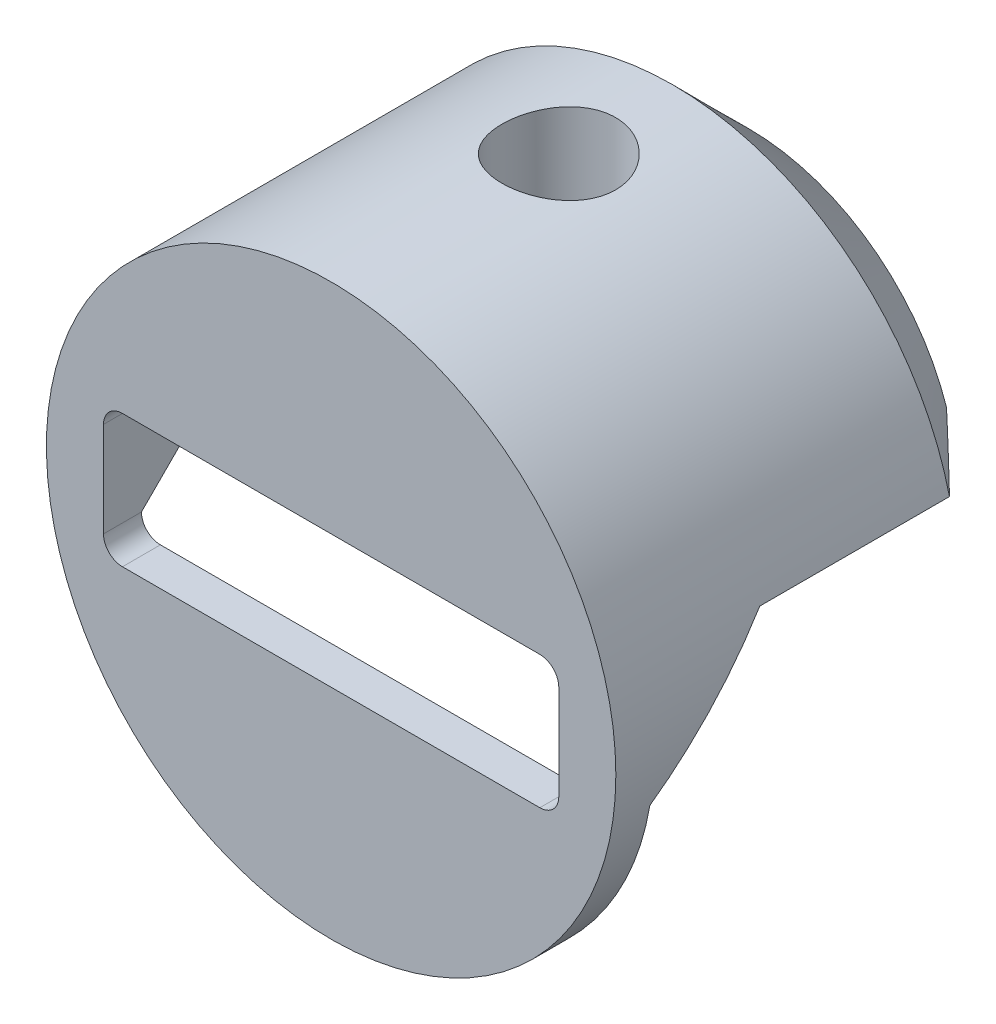
ISO-10303-21;
HEADER;
FILE_DESCRIPTION(('STEP AP214'),'2;1');
FILE_NAME('part.step','',(''),(''),'','','');
FILE_SCHEMA(('AUTOMOTIVE_DESIGN { 1 0 10303 214 1 1 1 1 }'));
ENDSEC;
DATA;
#1=APPLICATION_CONTEXT('core data for automotive mechanical design processes');
#2=APPLICATION_PROTOCOL_DEFINITION('international standard','automotive_design',2000,#1);
#3=PRODUCT_CONTEXT('',#1,'mechanical');
#4=PRODUCT('Part','Part','',(#3));
#5=PRODUCT_RELATED_PRODUCT_CATEGORY('part','',(#4));
#6=PRODUCT_DEFINITION_FORMATION('','',#4);
#7=PRODUCT_DEFINITION_CONTEXT('part definition',#1,'design');
#8=PRODUCT_DEFINITION('design','',#6,#7);
#9=PRODUCT_DEFINITION_SHAPE('','',#8);
#10=(LENGTH_UNIT() NAMED_UNIT(*) SI_UNIT(.MILLI.,.METRE.));
#11=(NAMED_UNIT(*) PLANE_ANGLE_UNIT() SI_UNIT($,.RADIAN.));
#12=(NAMED_UNIT(*) SI_UNIT($,.STERADIAN.) SOLID_ANGLE_UNIT());
#13=UNCERTAINTY_MEASURE_WITH_UNIT(LENGTH_MEASURE(1.E-05),#10,'distance_accuracy_value','');
#14=(GEOMETRIC_REPRESENTATION_CONTEXT(3) GLOBAL_UNCERTAINTY_ASSIGNED_CONTEXT((#13)) GLOBAL_UNIT_ASSIGNED_CONTEXT((#10,
#11,#12)) REPRESENTATION_CONTEXT('',''));
#15=CARTESIAN_POINT('',(0.,0.,0.));
#16=DIRECTION('',(0.,0.,1.));
#17=DIRECTION('',(1.,0.,0.));
#18=AXIS2_PLACEMENT_3D('',#15,#16,#17);
#19=CARTESIAN_POINT('',(0.,0.,0.));
#20=DIRECTION('',(0.,0.,1.));
#21=DIRECTION('',(1.,0.,0.));
#22=AXIS2_PLACEMENT_3D('',#19,#20,#21);
#23=PLANE('',#22);
#24=CARTESIAN_POINT('',(17.4625,-3.96875,0.));
#25=DIRECTION('',(0.,0.,1.));
#26=DIRECTION('',(1.,0.,0.));
#27=AXIS2_PLACEMENT_3D('',#24,#25,#26);
#28=CIRCLE('',#27,1.5875);
#29=CARTESIAN_POINT('',(17.4625,-5.55625,0.));
#30=VERTEX_POINT('',#29);
#31=CARTESIAN_POINT('',(19.05,-3.96875,0.));
#32=VERTEX_POINT('',#31);
#33=EDGE_CURVE('E176',#30,#32,#28,.T.);
#34=ORIENTED_EDGE('',*,*,#33,.T.);
#35=DIRECTION('',(1.,0.,0.));
#36=VECTOR('',#35,1.);
#37=CARTESIAN_POINT('',(23.1682593428488,-3.96874999999997,0.));
#38=LINE('',#37,#36);
#39=CARTESIAN_POINT('',(23.492321691938,-3.96874999999997,0.));
#40=VERTEX_POINT('',#39);
#41=EDGE_CURVE('E191',#32,#40,#38,.T.);
#42=ORIENTED_EDGE('',*,*,#41,.T.);
#43=CARTESIAN_POINT('',(0.,0.,0.));
#44=DIRECTION('',(0.,0.,1.));
#45=DIRECTION('',(1.,0.,0.));
#46=AXIS2_PLACEMENT_3D('',#43,#44,#45);
#47=CIRCLE('',#46,23.8252);
#48=CARTESIAN_POINT('',(-23.492321691938,-3.96874999999997,0.));
#49=VERTEX_POINT('',#48);
#50=EDGE_CURVE('E150',#49,#40,#47,.T.);
#51=ORIENTED_EDGE('',*,*,#50,.F.);
#52=DIRECTION('',(1.,0.,0.));
#53=VECTOR('',#52,1.);
#54=CARTESIAN_POINT('',(-17.4625,-3.96874999999997,0.));
#55=LINE('',#54,#53);
#56=CARTESIAN_POINT('',(-19.05,-3.96875,0.));
#57=VERTEX_POINT('',#56);
#58=EDGE_CURVE('E189',#49,#57,#55,.T.);
#59=ORIENTED_EDGE('',*,*,#58,.T.);
#60=CARTESIAN_POINT('',(-17.4625,-3.96875,0.));
#61=DIRECTION('',(0.,0.,1.));
#62=DIRECTION('',(1.,0.,0.));
#63=AXIS2_PLACEMENT_3D('',#60,#61,#62);
#64=CIRCLE('',#63,1.5875);
#65=CARTESIAN_POINT('',(-17.4625,-5.55625,0.));
#66=VERTEX_POINT('',#65);
#67=EDGE_CURVE('E130',#57,#66,#64,.T.);
#68=ORIENTED_EDGE('',*,*,#67,.T.);
#69=DIRECTION('',(1.,0.,0.));
#70=VECTOR('',#69,1.);
#71=CARTESIAN_POINT('',(-19.05,-5.55625,0.));
#72=LINE('',#71,#70);
#73=EDGE_CURVE('E140',#66,#30,#72,.T.);
#74=ORIENTED_EDGE('',*,*,#73,.T.);
#75=EDGE_LOOP('',(#34,#42,#51,#59,#68,#74));
#76=FACE_BOUND('',#75,.T.);
#77=ADVANCED_FACE('F32',(#76),#23,.F.);
#78=CARTESIAN_POINT('',(0.,0.,3.175));
#79=DIRECTION('',(0.,0.,-1.));
#80=DIRECTION('',(-1.,0.,0.));
#81=AXIS2_PLACEMENT_3D('',#78,#79,#80);
#82=CYLINDRICAL_SURFACE('',#81,23.8252);
#83=CARTESIAN_POINT('',(0.,23.8252,-11.1125));
#84=CARTESIAN_POINT('',(-0.26468798628504,23.8251951226979,-11.1125097405284));
#85=CARTESIAN_POINT('',(-0.529499143477237,23.8207438683323,-11.1346406112875));
#86=CARTESIAN_POINT('',(-1.051636545125,23.8034162854459,-11.2225091782623));
#87=CARTESIAN_POINT('',(-1.30895667009785,23.7905332600903,-11.2882815367889));
#88=CARTESIAN_POINT('',(-1.80848726659535,23.7577807317868,-11.461320228174));
#89=CARTESIAN_POINT('',(-2.05071194625906,23.7379179189587,-11.5685468369962));
#90=CARTESIAN_POINT('',(-2.51371611976274,23.693365181789,-11.8213322650753));
#91=CARTESIAN_POINT('',(-2.73449689373966,23.6686755458597,-11.966888794223));
#92=CARTESIAN_POINT('',(-3.15134989484519,23.6168130916919,-12.2942900255091));
#93=CARTESIAN_POINT('',(-3.34709020597491,23.5896138029903,-12.476553177339));
#94=CARTESIAN_POINT('',(-3.7054319432322,23.5359901883143,-12.8712943458714));
#95=CARTESIAN_POINT('',(-3.86803078304261,23.5095659229592,-13.0837747184914));
#96=CARTESIAN_POINT('',(-4.15688647253994,23.460225713389,-13.5353059021012));
#97=CARTESIAN_POINT('',(-4.2827996943948,23.4373438273569,-13.7745805913275));
#98=CARTESIAN_POINT('',(-4.49250853830897,23.3980550251738,-14.2714228610609));
#99=CARTESIAN_POINT('',(-4.57630831645973,23.3816474701185,-14.5289886335933));
#100=CARTESIAN_POINT('',(-4.69833409248501,23.3574328374087,-15.0515308479983));
#101=CARTESIAN_POINT('',(-4.73714240094976,23.3495159704266,-15.3163661153228));
#102=CARTESIAN_POINT('',(-4.76989230678561,23.3428486218898,-15.8488979880102));
#103=CARTESIAN_POINT('',(-4.76383848688287,23.3440972040721,-16.1165942983241));
#104=CARTESIAN_POINT('',(-4.70750679862519,23.3555199246904,-16.6429893633404));
#105=CARTESIAN_POINT('',(-4.65789642626372,23.3655593391066,-16.9017629090314));
#106=CARTESIAN_POINT('',(-4.51691348526417,23.3932204072653,-17.4072384759464));
#107=CARTESIAN_POINT('',(-4.42553892411795,23.4108424227603,-17.6539399206065));
#108=CARTESIAN_POINT('',(-4.20298388778795,23.4518209024325,-18.13019224204));
#109=CARTESIAN_POINT('',(-4.07153879776745,23.4752152837995,-18.3596160653276));
#110=CARTESIAN_POINT('',(-3.77276065905317,23.5250781856318,-18.7934007804313));
#111=CARTESIAN_POINT('',(-3.60542349013793,23.5515470588726,-18.9977587905872));
#112=CARTESIAN_POINT('',(-3.23603720806696,23.6051602461935,-19.3794625389199));
#113=CARTESIAN_POINT('',(-3.03341838696737,23.632308150872,-19.5562569098447));
#114=CARTESIAN_POINT('',(-2.60111373354849,23.6837849672359,-19.8734353224583));
#115=CARTESIAN_POINT('',(-2.37142755485921,23.7081138428394,-20.0138188981393));
#116=CARTESIAN_POINT('',(-1.89089599288597,23.751271088371,-20.2542925775217));
#117=CARTESIAN_POINT('',(-1.64001827019372,23.7700908483035,-20.3543197008983));
#118=CARTESIAN_POINT('',(-1.12455933520331,23.8000440143785,-20.5106534569724));
#119=CARTESIAN_POINT('',(-0.859979785236095,23.8111783505931,-20.5669653800851));
#120=CARTESIAN_POINT('',(-0.329365799052263,23.8243766192916,-20.6334897510486));
#121=CARTESIAN_POINT('',(-0.0634295428226747,23.8265890023631,-20.6444567624915));
#122=CARTESIAN_POINT('',(0.466475600664106,23.8221064051307,-20.6220120613979));
#123=CARTESIAN_POINT('',(0.730444597555633,23.8154119249913,-20.5886028408071));
#124=CARTESIAN_POINT('',(1.24648820062702,23.7939606956564,-20.4789809192764));
#125=CARTESIAN_POINT('',(1.49864834022506,23.7792768950398,-20.4031553384192));
#126=CARTESIAN_POINT('',(1.9866752164669,23.7434875435489,-20.2112760989188));
#127=CARTESIAN_POINT('',(2.2225407317865,23.7223815119511,-20.0952194287661));
#128=CARTESIAN_POINT('',(2.67446558734583,23.6757192769061,-19.8245397116214));
#129=CARTESIAN_POINT('',(2.89024739234771,23.6501118006517,-19.6694623195766));
#130=CARTESIAN_POINT('',(3.29299604846084,23.5974079305252,-19.325751656197));
#131=CARTESIAN_POINT('',(3.47995980972587,23.5703113774173,-19.1371147913085));
#132=CARTESIAN_POINT('',(3.82267696210409,23.5171829860366,-18.7282050729517));
#133=CARTESIAN_POINT('',(3.97791237112328,23.4911736116975,-18.5074946625058));
#134=CARTESIAN_POINT('',(4.24910849107445,23.4436402043821,-18.0426879104587));
#135=CARTESIAN_POINT('',(4.36507077251343,23.4221159920603,-17.7985925045091));
#136=CARTESIAN_POINT('',(4.55372148776744,23.3861713550083,-17.295173592899));
#137=CARTESIAN_POINT('',(4.62663414956219,23.3717141899794,-17.0359368626934));
#138=CARTESIAN_POINT('',(4.72779601677021,23.3514626755826,-16.5085717799287));
#139=CARTESIAN_POINT('',(4.75605103956951,23.3456671978939,-16.2404445901437));
#140=CARTESIAN_POINT('',(4.76688045509302,23.343457835273,-15.7081102898444));
#141=CARTESIAN_POINT('',(4.75027334199977,23.3468758508765,-15.4439201878407));
#142=CARTESIAN_POINT('',(4.67365621591802,23.3623327917658,-14.9221807235454));
#143=CARTESIAN_POINT('',(4.61364655074543,23.3743716479666,-14.6646313080544));
#144=CARTESIAN_POINT('',(4.4522927130697,23.4056386743259,-14.164004180388));
#145=CARTESIAN_POINT('',(4.35104880616727,23.4248493959242,-13.9208929916534));
#146=CARTESIAN_POINT('',(4.1101943499799,23.4683055894606,-13.4549797519493));
#147=CARTESIAN_POINT('',(3.97058058793866,23.4925514829584,-13.2321794037133));
#148=CARTESIAN_POINT('',(3.65415355273115,23.5438605220351,-12.8091365090426));
#149=CARTESIAN_POINT('',(3.47674915024675,23.5709644976961,-12.6093409861549));
#150=CARTESIAN_POINT('',(3.09099715455224,23.6246425923784,-12.2420842713216));
#151=CARTESIAN_POINT('',(2.88264245988113,23.6512165882057,-12.0746305204446));
#152=CARTESIAN_POINT('',(2.43828745704218,23.7011680331646,-11.7751582301449));
#153=CARTESIAN_POINT('',(2.20202095356028,23.7245091681388,-11.6435283611549));
#154=CARTESIAN_POINT('',(1.71032148041436,23.76500754123,-11.4220486949781));
#155=CARTESIAN_POINT('',(1.45490603494739,23.7821703519664,-11.3321612263583));
#156=CARTESIAN_POINT('',(0.999096399441274,23.8050427288747,-11.2141333985186));
#157=CARTESIAN_POINT('',(0.801297508733566,23.8125574811857,-11.1760888033963));
#158=CARTESIAN_POINT('',(0.4023560674452,23.8226378918748,-11.1252688037122));
#159=CARTESIAN_POINT('',(0.201213623432525,23.8252037076848,-11.1124925953307));
#160=CARTESIAN_POINT('',(0.,23.8252,-11.1125));
#161=B_SPLINE_CURVE_WITH_KNOTS('',3,(#83,#84,#85,#86,#87,#88,#89,#90,#91,#92,#93,#94,#95,#96,
#97,#98,#99,#100,#101,#102,#103,#104,#105,#106,#107,#108,#109,#110,#111,#112,#113,#114,#115,
#116,#117,#118,#119,#120,#121,#122,#123,#124,#125,#126,#127,#128,#129,#130,#131,#132,#133,#134,
#135,#136,#137,#138,#139,#140,#141,#142,#143,#144,#145,#146,#147,#148,#149,#150,#151,#152,#153,
#154,#155,#156,#157,#158,#159,#160),.UNSPECIFIED.,.T.,.F.,(4,2,2,2,2,2,2,2,2,2,2,2,2,2,2,2,2,2,
2,2,2,2,2,2,2,2,2,2,2,2,2,2,2,2,2,2,2,2,4),(0.,0.793327860915134,1.58728657901616,
2.38048635489683,3.17363874998478,3.97640459937808,4.77923307160471,5.58935606576586,
6.39939909480266,7.19883663006741,7.99819250284918,8.78550811776589,9.57286129827623,
10.3655309125319,11.1582915698278,11.9652973343436,12.7723134269064,13.5805841228718,
14.3887569866304,15.183425921418,15.9780502334881,16.7655378910984,17.5530845090494,
18.3502636420721,19.1475281885986,19.9569195480793,20.7662785366994,21.5713838393825,
22.3763842553186,23.1667973739987,23.9572041585993,24.7457003490998,25.5342625815049,
26.3362081655445,27.1383380388656,27.9488519432575,28.75863295152,29.3617334319436,
29.9648147266601),.UNSPECIFIED.);
#162=CARTESIAN_POINT('',(0.,23.8252,-11.1125));
#163=VERTEX_POINT('',#162);
#164=EDGE_CURVE('E209',#163,#163,#161,.T.);
#165=ORIENTED_EDGE('',*,*,#164,.T.);
#166=EDGE_LOOP('',(#165));
#167=FACE_BOUND('',#166,.T.);
#168=CARTESIAN_POINT('',(0.,0.,3.175));
#169=DIRECTION('',(0.,0.,1.));
#170=DIRECTION('',(1.,0.,0.));
#171=AXIS2_PLACEMENT_3D('',#168,#169,#170);
#172=CIRCLE('',#171,23.8252);
#173=CARTESIAN_POINT('',(23.8252,0.,3.175));
#174=VERTEX_POINT('',#173);
#175=EDGE_CURVE('E156',#174,#174,#172,.T.);
#176=ORIENTED_EDGE('',*,*,#175,.F.);
#177=EDGE_LOOP('',(#176));
#178=FACE_BOUND('',#177,.T.);
#179=DIRECTION('',(0.,0.,1.));
#180=VECTOR('',#179,1.);
#181=CARTESIAN_POINT('',(23.1682593428488,5.55625,-31.75));
#182=LINE('',#181,#180);
#183=CARTESIAN_POINT('',(23.1682593428488,5.55625,-25.4));
#184=VERTEX_POINT('',#183);
#185=CARTESIAN_POINT('',(23.1682593428488,5.55625,-9.52500000000006));
#186=VERTEX_POINT('',#185);
#187=EDGE_CURVE('E274',#184,#186,#182,.T.);
#188=ORIENTED_EDGE('',*,*,#187,.F.);
#189=CARTESIAN_POINT('',(0.,0.,-25.4));
#190=DIRECTION('',(0.,0.,-1.));
#191=DIRECTION('',(-1.,0.,0.));
#192=AXIS2_PLACEMENT_3D('',#189,#190,#191);
#193=CIRCLE('',#192,23.8252);
#194=CARTESIAN_POINT('',(-23.1682593428488,5.55625,-25.4));
#195=VERTEX_POINT('',#194);
#196=EDGE_CURVE('E11',#184,#195,#193,.F.);
#197=ORIENTED_EDGE('',*,*,#196,.T.);
#198=DIRECTION('',(0.,0.,1.));
#199=VECTOR('',#198,1.);
#200=CARTESIAN_POINT('',(-23.1682593428488,5.55625,-31.75));
#201=LINE('',#200,#199);
#202=CARTESIAN_POINT('',(-23.1682593428488,5.55625,-9.52500000000006));
#203=VERTEX_POINT('',#202);
#204=EDGE_CURVE('E276',#195,#203,#201,.T.);
#205=ORIENTED_EDGE('',*,*,#204,.T.);
#206=CARTESIAN_POINT('',(0.,0.,-3.96875000000001));
#207=DIRECTION('',(0.,-0.707106781186551,-0.707106781186544));
#208=DIRECTION('',(0.,0.707106781186544,-0.707106781186551));
#209=AXIS2_PLACEMENT_3D('',#206,#207,#208);
#210=ELLIPSE('',#209,33.6939209662516,23.8252);
#211=EDGE_CURVE('E201',#203,#49,#210,.F.);
#212=ORIENTED_EDGE('',*,*,#211,.T.);
#213=ORIENTED_EDGE('',*,*,#50,.T.);
#214=CARTESIAN_POINT('',(0.,0.,-3.96875000000001));
#215=DIRECTION('',(0.,-0.707106781186551,-0.707106781186544));
#216=DIRECTION('',(0.,0.707106781186544,-0.707106781186551));
#217=AXIS2_PLACEMENT_3D('',#214,#215,#216);
#218=ELLIPSE('',#217,33.6939209662516,23.8252);
#219=EDGE_CURVE('E198',#40,#186,#218,.F.);
#220=ORIENTED_EDGE('',*,*,#219,.T.);
#221=EDGE_LOOP('',(#188,#197,#205,#212,#213,#220));
#222=FACE_BOUND('',#221,.T.);
#223=ADVANCED_FACE('F220',(#167,#178,#222),#82,.T.);
#224=CARTESIAN_POINT('',(0.,0.,3.175));
#225=DIRECTION('',(0.,0.,1.));
#226=DIRECTION('',(1.,0.,0.));
#227=AXIS2_PLACEMENT_3D('',#224,#225,#226);
#228=PLANE('',#227);
#229=DIRECTION('',(0.,1.,0.));
#230=VECTOR('',#229,1.);
#231=CARTESIAN_POINT('',(19.05,-5.55625,3.175));
#232=LINE('',#231,#230);
#233=CARTESIAN_POINT('',(19.05,-3.96875,3.175));
#234=VERTEX_POINT('',#233);
#235=CARTESIAN_POINT('',(19.05,3.96875,3.175));
#236=VERTEX_POINT('',#235);
#237=EDGE_CURVE('E283',#234,#236,#232,.T.);
#238=ORIENTED_EDGE('',*,*,#237,.F.);
#239=CARTESIAN_POINT('',(17.4625,-3.96875,3.175));
#240=DIRECTION('',(0.,0.,1.));
#241=DIRECTION('',(1.,0.,0.));
#242=AXIS2_PLACEMENT_3D('',#239,#240,#241);
#243=CIRCLE('',#242,1.5875);
#244=CARTESIAN_POINT('',(17.4625,-5.55625,3.175));
#245=VERTEX_POINT('',#244);
#246=EDGE_CURVE('E147',#234,#245,#243,.F.);
#247=ORIENTED_EDGE('',*,*,#246,.T.);
#248=DIRECTION('',(1.,0.,0.));
#249=VECTOR('',#248,1.);
#250=CARTESIAN_POINT('',(-19.05,-5.55625,3.175));
#251=LINE('',#250,#249);
#252=CARTESIAN_POINT('',(-17.4625,-5.55625,3.175));
#253=VERTEX_POINT('',#252);
#254=EDGE_CURVE('E137',#253,#245,#251,.T.);
#255=ORIENTED_EDGE('',*,*,#254,.F.);
#256=CARTESIAN_POINT('',(-17.4625,-3.96875,3.175));
#257=DIRECTION('',(0.,0.,1.));
#258=DIRECTION('',(1.,0.,0.));
#259=AXIS2_PLACEMENT_3D('',#256,#257,#258);
#260=CIRCLE('',#259,1.5875);
#261=CARTESIAN_POINT('',(-19.05,-3.96875,3.175));
#262=VERTEX_POINT('',#261);
#263=EDGE_CURVE('E119',#253,#262,#260,.F.);
#264=ORIENTED_EDGE('',*,*,#263,.T.);
#265=DIRECTION('',(0.,-1.,0.));
#266=VECTOR('',#265,1.);
#267=CARTESIAN_POINT('',(-19.05,-5.55625,3.175));
#268=LINE('',#267,#266);
#269=CARTESIAN_POINT('',(-19.05,3.96875,3.175));
#270=VERTEX_POINT('',#269);
#271=EDGE_CURVE('E148',#270,#262,#268,.T.);
#272=ORIENTED_EDGE('',*,*,#271,.F.);
#273=CARTESIAN_POINT('',(-17.4625,3.96875,3.175));
#274=DIRECTION('',(0.,0.,1.));
#275=DIRECTION('',(1.,0.,0.));
#276=AXIS2_PLACEMENT_3D('',#273,#274,#275);
#277=CIRCLE('',#276,1.5875);
#278=CARTESIAN_POINT('',(-17.4625,5.55625,3.175));
#279=VERTEX_POINT('',#278);
#280=EDGE_CURVE('E181',#270,#279,#277,.F.);
#281=ORIENTED_EDGE('',*,*,#280,.T.);
#282=DIRECTION('',(-1.,0.,0.));
#283=VECTOR('',#282,1.);
#284=CARTESIAN_POINT('',(-19.05,5.55625,3.175));
#285=LINE('',#284,#283);
#286=CARTESIAN_POINT('',(17.4625,5.55625,3.175));
#287=VERTEX_POINT('',#286);
#288=EDGE_CURVE('E152',#287,#279,#285,.T.);
#289=ORIENTED_EDGE('',*,*,#288,.F.);
#290=CARTESIAN_POINT('',(17.4625,3.96875,3.175));
#291=DIRECTION('',(0.,0.,1.));
#292=DIRECTION('',(1.,0.,0.));
#293=AXIS2_PLACEMENT_3D('',#290,#291,#292);
#294=CIRCLE('',#293,1.5875);
#295=EDGE_CURVE('E179',#287,#236,#294,.F.);
#296=ORIENTED_EDGE('',*,*,#295,.T.);
#297=EDGE_LOOP('',(#238,#247,#255,#264,#272,#281,#289,#296));
#298=FACE_BOUND('',#297,.T.);
#299=ORIENTED_EDGE('',*,*,#175,.T.);
#300=EDGE_LOOP('',(#299));
#301=FACE_BOUND('',#300,.T.);
#302=ADVANCED_FACE('F145',(#298,#301),#228,.T.);
#303=CARTESIAN_POINT('',(19.05,-5.55625,0.));
#304=DIRECTION('',(1.,0.,0.));
#305=DIRECTION('',(0.,0.,-1.));
#306=AXIS2_PLACEMENT_3D('',#303,#304,#305);
#307=PLANE('',#306);
#308=DIRECTION('',(0.,0.,1.));
#309=VECTOR('',#308,1.);
#310=CARTESIAN_POINT('',(19.05,3.96875,0.));
#311=LINE('',#310,#309);
#312=CARTESIAN_POINT('',(19.05,3.96875,-7.93750000000005));
#313=VERTEX_POINT('',#312);
#314=EDGE_CURVE('E165',#236,#313,#311,.F.);
#315=ORIENTED_EDGE('',*,*,#314,.T.);
#316=DIRECTION('',(0.,0.707106781186544,-0.707106781186551));
#317=VECTOR('',#316,1.);
#318=CARTESIAN_POINT('',(19.05,-4.76249999999998,0.793750000000014));
#319=LINE('',#318,#317);
#320=EDGE_CURVE('E196',#313,#32,#319,.F.);
#321=ORIENTED_EDGE('',*,*,#320,.T.);
#322=DIRECTION('',(0.,0.,1.));
#323=VECTOR('',#322,1.);
#324=CARTESIAN_POINT('',(19.05,-3.96875,3.175));
#325=LINE('',#324,#323);
#326=EDGE_CURVE('E167',#32,#234,#325,.T.);
#327=ORIENTED_EDGE('',*,*,#326,.T.);
#328=ORIENTED_EDGE('',*,*,#237,.T.);
#329=EDGE_LOOP('',(#315,#321,#327,#328));
#330=FACE_BOUND('',#329,.T.);
#331=ADVANCED_FACE('F247',(#330),#307,.F.);
#332=CARTESIAN_POINT('',(-19.05,-5.55625,0.));
#333=DIRECTION('',(0.,-1.,0.));
#334=DIRECTION('',(0.,0.,-1.));
#335=AXIS2_PLACEMENT_3D('',#332,#333,#334);
#336=PLANE('',#335);
#337=ORIENTED_EDGE('',*,*,#73,.F.);
#338=DIRECTION('',(0.,0.,1.));
#339=VECTOR('',#338,1.);
#340=CARTESIAN_POINT('',(-17.4625,-5.55625,3.175));
#341=LINE('',#340,#339);
#342=EDGE_CURVE('E123',#66,#253,#341,.T.);
#343=ORIENTED_EDGE('',*,*,#342,.T.);
#344=ORIENTED_EDGE('',*,*,#254,.T.);
#345=DIRECTION('',(0.,0.,1.));
#346=VECTOR('',#345,1.);
#347=CARTESIAN_POINT('',(17.4625,-5.55625,0.));
#348=LINE('',#347,#346);
#349=EDGE_CURVE('E142',#245,#30,#348,.F.);
#350=ORIENTED_EDGE('',*,*,#349,.T.);
#351=EDGE_LOOP('',(#337,#343,#344,#350));
#352=FACE_BOUND('',#351,.T.);
#353=ADVANCED_FACE('F136',(#352),#336,.F.);
#354=CARTESIAN_POINT('',(-19.05,-5.55625,0.));
#355=DIRECTION('',(-1.,0.,0.));
#356=DIRECTION('',(0.,0.,1.));
#357=AXIS2_PLACEMENT_3D('',#354,#355,#356);
#358=PLANE('',#357);
#359=ORIENTED_EDGE('',*,*,#271,.T.);
#360=DIRECTION('',(0.,0.,1.));
#361=VECTOR('',#360,1.);
#362=CARTESIAN_POINT('',(-19.05,-3.96875,0.));
#363=LINE('',#362,#361);
#364=EDGE_CURVE('E125',#262,#57,#363,.F.);
#365=ORIENTED_EDGE('',*,*,#364,.T.);
#366=DIRECTION('',(0.,-0.707106781186544,0.707106781186551));
#367=VECTOR('',#366,1.);
#368=CARTESIAN_POINT('',(-19.05,-4.76249999999998,0.793750000000014));
#369=LINE('',#368,#367);
#370=CARTESIAN_POINT('',(-19.05,3.96875,-7.93750000000005));
#371=VERTEX_POINT('',#370);
#372=EDGE_CURVE('E203',#57,#371,#369,.F.);
#373=ORIENTED_EDGE('',*,*,#372,.T.);
#374=DIRECTION('',(0.,0.,1.));
#375=VECTOR('',#374,1.);
#376=CARTESIAN_POINT('',(-19.05,3.96875,3.175));
#377=LINE('',#376,#375);
#378=EDGE_CURVE('E141',#371,#270,#377,.T.);
#379=ORIENTED_EDGE('',*,*,#378,.T.);
#380=EDGE_LOOP('',(#359,#365,#373,#379));
#381=FACE_BOUND('',#380,.T.);
#382=ADVANCED_FACE('F246',(#381),#358,.F.);
#383=CARTESIAN_POINT('',(-19.05,5.55625,0.));
#384=DIRECTION('',(0.,1.,0.));
#385=DIRECTION('',(0.,0.,1.));
#386=AXIS2_PLACEMENT_3D('',#383,#384,#385);
#387=PLANE('',#386);
#388=CARTESIAN_POINT('',(0.,5.55625,-15.875));
#389=DIRECTION('',(0.,1.,0.));
#390=DIRECTION('',(0.,0.,1.));
#391=AXIS2_PLACEMENT_3D('',#388,#389,#390);
#392=CIRCLE('',#391,2.24789999999999);
#393=CARTESIAN_POINT('',(0.,5.55625,-13.6271));
#394=VERTEX_POINT('',#393);
#395=EDGE_CURVE('E218',#394,#394,#392,.T.);
#396=ORIENTED_EDGE('',*,*,#395,.T.);
#397=EDGE_LOOP('',(#396));
#398=FACE_BOUND('',#397,.T.);
#399=DIRECTION('',(-1.,0.,0.));
#400=VECTOR('',#399,1.);
#401=CARTESIAN_POINT('',(23.1682593428488,5.55625,-31.75));
#402=LINE('',#401,#400);
#403=CARTESIAN_POINT('',(16.5683644629607,5.55625,-31.75));
#404=VERTEX_POINT('',#403);
#405=CARTESIAN_POINT('',(-16.5683644629607,5.55625,-31.75));
#406=VERTEX_POINT('',#405);
#407=EDGE_CURVE('E272',#404,#406,#402,.T.);
#408=ORIENTED_EDGE('',*,*,#407,.F.);
#409=CARTESIAN_POINT('',(16.5683644629607,5.55625,-31.75));
#410=CARTESIAN_POINT('',(17.1221993275467,5.55625,-31.2248399203684));
#411=CARTESIAN_POINT('',(17.674769977535,5.55625,-30.6983511339137));
#412=CARTESIAN_POINT('',(18.7778567282102,5.55625,-29.6432355826357));
#413=CARTESIAN_POINT('',(19.328372848644,5.55625,-29.1146088384635));
#414=CARTESIAN_POINT('',(20.42783284588,5.55625,-28.0557288133014));
#415=CARTESIAN_POINT('',(20.9767767290497,5.55625,-27.5254755389171));
#416=CARTESIAN_POINT('',(22.0733963345036,5.55625,-26.4636485349157));
#417=CARTESIAN_POINT('',(22.6210720446097,5.55625,-25.932074792719));
#418=CARTESIAN_POINT('',(23.1682593428488,5.55625,-25.4));
#419=B_SPLINE_CURVE_WITH_KNOTS('',3,(#409,#410,#411,#412,#413,#414,#415,#416,#417,#418),
.UNSPECIFIED.,.F.,.F.,(4,2,2,2,4),(0.,2.28969538996042,4.57936871581745,6.86903275542798,
9.15871869222442),.UNSPECIFIED.);
#420=EDGE_CURVE('E41',#404,#184,#419,.T.);
#421=ORIENTED_EDGE('',*,*,#420,.T.);
#422=ORIENTED_EDGE('',*,*,#187,.T.);
#423=DIRECTION('',(-1.,0.,0.));
#424=VECTOR('',#423,1.);
#425=CARTESIAN_POINT('',(17.4625,5.55625,-9.52500000000006));
#426=LINE('',#425,#424);
#427=CARTESIAN_POINT('',(17.4625,5.55625,-9.52500000000006));
#428=VERTEX_POINT('',#427);
#429=EDGE_CURVE('E186',#186,#428,#426,.T.);
#430=ORIENTED_EDGE('',*,*,#429,.T.);
#431=DIRECTION('',(0.,0.,1.));
#432=VECTOR('',#431,1.);
#433=CARTESIAN_POINT('',(17.4625,5.55625,3.175));
#434=LINE('',#433,#432);
#435=EDGE_CURVE('E131',#428,#287,#434,.T.);
#436=ORIENTED_EDGE('',*,*,#435,.T.);
#437=ORIENTED_EDGE('',*,*,#288,.T.);
#438=DIRECTION('',(0.,0.,1.));
#439=VECTOR('',#438,1.);
#440=CARTESIAN_POINT('',(-17.4625,5.55625,0.));
#441=LINE('',#440,#439);
#442=CARTESIAN_POINT('',(-17.4625,5.55625,-9.52500000000006));
#443=VERTEX_POINT('',#442);
#444=EDGE_CURVE('E170',#279,#443,#441,.F.);
#445=ORIENTED_EDGE('',*,*,#444,.T.);
#446=DIRECTION('',(-1.,0.,0.));
#447=VECTOR('',#446,1.);
#448=CARTESIAN_POINT('',(-23.1682593428488,5.55625,-9.52500000000006));
#449=LINE('',#448,#447);
#450=EDGE_CURVE('E183',#443,#203,#449,.T.);
#451=ORIENTED_EDGE('',*,*,#450,.T.);
#452=ORIENTED_EDGE('',*,*,#204,.F.);
#453=CARTESIAN_POINT('',(-23.1682593428488,5.55625,-25.4));
#454=CARTESIAN_POINT('',(-22.6210720446097,5.55625,-25.932074792719));
#455=CARTESIAN_POINT('',(-22.0733963345036,5.55625,-26.4636485349157));
#456=CARTESIAN_POINT('',(-20.9767767290497,5.55625,-27.5254755389171));
#457=CARTESIAN_POINT('',(-20.4278328458799,5.55625,-28.0557288133014));
#458=CARTESIAN_POINT('',(-19.328372848644,5.55625,-29.1146088384635));
#459=CARTESIAN_POINT('',(-18.7778567282102,5.55625,-29.6432355826357));
#460=CARTESIAN_POINT('',(-17.674769977535,5.55625,-30.6983511339137));
#461=CARTESIAN_POINT('',(-17.1221993275467,5.55625,-31.2248399203685));
#462=CARTESIAN_POINT('',(-16.5683644629607,5.55625,-31.75));
#463=B_SPLINE_CURVE_WITH_KNOTS('',3,(#453,#454,#455,#456,#457,#458,#459,#460,#461,#462),
.UNSPECIFIED.,.F.,.F.,(4,2,2,2,4),(0.,2.28968593679644,4.57934997640697,6.86902330226401,
9.15871869222442),.UNSPECIFIED.);
#464=EDGE_CURVE('E259',#195,#406,#463,.T.);
#465=ORIENTED_EDGE('',*,*,#464,.T.);
#466=EDGE_LOOP('',(#408,#421,#422,#430,#436,#437,#445,#451,#452,#465));
#467=FACE_BOUND('',#466,.T.);
#468=ADVANCED_FACE('F250',(#398,#467),#387,.F.);
#469=CARTESIAN_POINT('',(-17.4625,-3.96875,0.));
#470=DIRECTION('',(0.,0.,-1.));
#471=DIRECTION('',(-1.,0.,0.));
#472=AXIS2_PLACEMENT_3D('',#469,#470,#471);
#473=CYLINDRICAL_SURFACE('',#472,1.5875);
#474=ORIENTED_EDGE('',*,*,#67,.F.);
#475=ORIENTED_EDGE('',*,*,#364,.F.);
#476=ORIENTED_EDGE('',*,*,#263,.F.);
#477=ORIENTED_EDGE('',*,*,#342,.F.);
#478=EDGE_LOOP('',(#474,#475,#476,#477));
#479=FACE_BOUND('',#478,.T.);
#480=ADVANCED_FACE('F122',(#479),#473,.F.);
#481=CARTESIAN_POINT('',(17.4625,-3.96875,0.));
#482=DIRECTION('',(0.,0.,-1.));
#483=DIRECTION('',(-1.,0.,0.));
#484=AXIS2_PLACEMENT_3D('',#481,#482,#483);
#485=CYLINDRICAL_SURFACE('',#484,1.5875);
#486=ORIENTED_EDGE('',*,*,#33,.F.);
#487=ORIENTED_EDGE('',*,*,#349,.F.);
#488=ORIENTED_EDGE('',*,*,#246,.F.);
#489=ORIENTED_EDGE('',*,*,#326,.F.);
#490=EDGE_LOOP('',(#486,#487,#488,#489));
#491=FACE_BOUND('',#490,.T.);
#492=ADVANCED_FACE('F325',(#491),#485,.F.);
#493=CARTESIAN_POINT('',(17.4625,3.96875,0.));
#494=DIRECTION('',(0.,0.,-1.));
#495=DIRECTION('',(-1.,0.,0.));
#496=AXIS2_PLACEMENT_3D('',#493,#494,#495);
#497=CYLINDRICAL_SURFACE('',#496,1.5875);
#498=ORIENTED_EDGE('',*,*,#435,.F.);
#499=CARTESIAN_POINT('',(17.4625,3.96875,-7.93750000000005));
#500=DIRECTION('',(0.,-0.707106781186551,-0.707106781186544));
#501=DIRECTION('',(0.,0.707106781186544,-0.707106781186551));
#502=AXIS2_PLACEMENT_3D('',#499,#500,#501);
#503=ELLIPSE('',#502,2.2450640302673,1.5875);
#504=EDGE_CURVE('E193',#428,#313,#503,.T.);
#505=ORIENTED_EDGE('',*,*,#504,.T.);
#506=ORIENTED_EDGE('',*,*,#314,.F.);
#507=ORIENTED_EDGE('',*,*,#295,.F.);
#508=EDGE_LOOP('',(#498,#505,#506,#507));
#509=FACE_BOUND('',#508,.T.);
#510=ADVANCED_FACE('F316',(#509),#497,.F.);
#511=CARTESIAN_POINT('',(-17.4625,3.96875,0.));
#512=DIRECTION('',(0.,0.,-1.));
#513=DIRECTION('',(-1.,0.,0.));
#514=AXIS2_PLACEMENT_3D('',#511,#512,#513);
#515=CYLINDRICAL_SURFACE('',#514,1.5875);
#516=ORIENTED_EDGE('',*,*,#378,.F.);
#517=CARTESIAN_POINT('',(-17.4625,3.96875,-7.93750000000005));
#518=DIRECTION('',(0.,-0.707106781186551,-0.707106781186544));
#519=DIRECTION('',(0.,0.707106781186544,-0.707106781186551));
#520=AXIS2_PLACEMENT_3D('',#517,#518,#519);
#521=ELLIPSE('',#520,2.2450640302673,1.5875);
#522=EDGE_CURVE('E206',#371,#443,#521,.T.);
#523=ORIENTED_EDGE('',*,*,#522,.T.);
#524=ORIENTED_EDGE('',*,*,#444,.F.);
#525=ORIENTED_EDGE('',*,*,#280,.F.);
#526=EDGE_LOOP('',(#516,#523,#524,#525));
#527=FACE_BOUND('',#526,.T.);
#528=ADVANCED_FACE('F242',(#527),#515,.F.);
#529=CARTESIAN_POINT('',(0.,0.,-31.75));
#530=DIRECTION('',(0.,0.,-1.));
#531=DIRECTION('',(-1.,0.,0.));
#532=AXIS2_PLACEMENT_3D('',#529,#530,#531);
#533=PLANE('',#532);
#534=ORIENTED_EDGE('',*,*,#407,.T.);
#535=CARTESIAN_POINT('',(0.,0.,-31.75));
#536=DIRECTION('',(0.,0.,-1.));
#537=DIRECTION('',(-1.,0.,0.));
#538=AXIS2_PLACEMENT_3D('',#535,#536,#537);
#539=CIRCLE('',#538,17.4752);
#540=EDGE_CURVE('E217',#406,#404,#539,.T.);
#541=ORIENTED_EDGE('',*,*,#540,.T.);
#542=EDGE_LOOP('',(#534,#541));
#543=FACE_BOUND('',#542,.T.);
#544=ADVANCED_FACE('F238',(#543),#533,.T.);
#545=CARTESIAN_POINT('',(-19.05,5.55625,-9.52500000000006));
#546=DIRECTION('',(0.,-0.707106781186551,-0.707106781186544));
#547=DIRECTION('',(1.,0.,0.));
#548=AXIS2_PLACEMENT_3D('',#545,#546,#547);
#549=PLANE('',#548);
#550=ORIENTED_EDGE('',*,*,#219,.F.);
#551=ORIENTED_EDGE('',*,*,#41,.F.);
#552=ORIENTED_EDGE('',*,*,#320,.F.);
#553=ORIENTED_EDGE('',*,*,#504,.F.);
#554=ORIENTED_EDGE('',*,*,#429,.F.);
#555=EDGE_LOOP('',(#550,#551,#552,#553,#554));
#556=FACE_BOUND('',#555,.T.);
#557=ADVANCED_FACE('F241',(#556),#549,.T.);
#558=CARTESIAN_POINT('',(-19.05,5.55625,-9.52500000000006));
#559=DIRECTION('',(0.,-0.707106781186551,-0.707106781186544));
#560=DIRECTION('',(1.,0.,0.));
#561=AXIS2_PLACEMENT_3D('',#558,#559,#560);
#562=PLANE('',#561);
#563=ORIENTED_EDGE('',*,*,#372,.F.);
#564=ORIENTED_EDGE('',*,*,#58,.F.);
#565=ORIENTED_EDGE('',*,*,#211,.F.);
#566=ORIENTED_EDGE('',*,*,#450,.F.);
#567=ORIENTED_EDGE('',*,*,#522,.F.);
#568=EDGE_LOOP('',(#563,#564,#565,#566,#567));
#569=FACE_BOUND('',#568,.T.);
#570=ADVANCED_FACE('F236',(#569),#562,.T.);
#571=CARTESIAN_POINT('',(0.,23.8252,-15.875));
#572=DIRECTION('',(0.,1.,0.));
#573=DIRECTION('',(0.,0.,1.));
#574=AXIS2_PLACEMENT_3D('',#571,#572,#573);
#575=CYLINDRICAL_SURFACE('',#574,2.24789999999999);
#576=CARTESIAN_POINT('',(0.,8.4582,-15.875));
#577=DIRECTION('',(0.,1.,0.));
#578=DIRECTION('',(0.,0.,1.));
#579=AXIS2_PLACEMENT_3D('',#576,#577,#578);
#580=CIRCLE('',#579,2.2479);
#581=CARTESIAN_POINT('',(0.,8.4582,-13.6271));
#582=VERTEX_POINT('',#581);
#583=EDGE_CURVE('E279',#582,#582,#580,.T.);
#584=ORIENTED_EDGE('',*,*,#583,.T.);
#585=EDGE_LOOP('',(#584));
#586=FACE_BOUND('',#585,.T.);
#587=ORIENTED_EDGE('',*,*,#395,.F.);
#588=EDGE_LOOP('',(#587));
#589=FACE_BOUND('',#588,.T.);
#590=ADVANCED_FACE('F229',(#586,#589),#575,.F.);
#591=CARTESIAN_POINT('',(0.,23.8252,-15.875));
#592=DIRECTION('',(0.,1.,0.));
#593=DIRECTION('',(0.,0.,1.));
#594=AXIS2_PLACEMENT_3D('',#591,#592,#593);
#595=CYLINDRICAL_SURFACE('',#594,4.76249999999999);
#596=CARTESIAN_POINT('',(0.,8.4582,-15.875));
#597=DIRECTION('',(0.,1.,0.));
#598=DIRECTION('',(0.,0.,1.));
#599=AXIS2_PLACEMENT_3D('',#596,#597,#598);
#600=CIRCLE('',#599,4.7625);
#601=CARTESIAN_POINT('',(0.,8.4582,-11.1125));
#602=VERTEX_POINT('',#601);
#603=EDGE_CURVE('E447',#602,#602,#600,.T.);
#604=ORIENTED_EDGE('',*,*,#603,.F.);
#605=EDGE_LOOP('',(#604));
#606=FACE_BOUND('',#605,.T.);
#607=ORIENTED_EDGE('',*,*,#164,.F.);
#608=EDGE_LOOP('',(#607));
#609=FACE_BOUND('',#608,.T.);
#610=ADVANCED_FACE('F224',(#606,#609),#595,.F.);
#611=CARTESIAN_POINT('',(2.2479,8.4582,-15.875));
#612=DIRECTION('',(0.,-1.,0.));
#613=DIRECTION('',(0.,0.,-1.));
#614=AXIS2_PLACEMENT_3D('',#611,#612,#613);
#615=PLANE('',#614);
#616=ORIENTED_EDGE('',*,*,#583,.F.);
#617=EDGE_LOOP('',(#616));
#618=FACE_BOUND('',#617,.T.);
#619=ORIENTED_EDGE('',*,*,#603,.T.);
#620=EDGE_LOOP('',(#619));
#621=FACE_BOUND('',#620,.T.);
#622=ADVANCED_FACE('F228',(#618,#621),#615,.F.);
#623=CARTESIAN_POINT('',(0.,0.,-31.75));
#624=DIRECTION('',(0.,0.,1.));
#625=DIRECTION('',(1.,0.,0.));
#626=AXIS2_PLACEMENT_3D('',#623,#624,#625);
#627=CONICAL_SURFACE('',#626,17.4752,0.785398163397447);
#628=ORIENTED_EDGE('',*,*,#464,.F.);
#629=ORIENTED_EDGE('',*,*,#196,.F.);
#630=ORIENTED_EDGE('',*,*,#420,.F.);
#631=ORIENTED_EDGE('',*,*,#540,.F.);
#632=EDGE_LOOP('',(#628,#629,#630,#631));
#633=FACE_BOUND('',#632,.T.);
#634=ADVANCED_FACE('F34',(#633),#627,.T.);
#635=CLOSED_SHELL('',(#77,#223,#302,#331,#353,#382,#468,#480,#492,#510,#528,#544,#557,#570,#590,
#610,#622,#634));
#636=MANIFOLD_SOLID_BREP('B2',#635);
#637=ADVANCED_BREP_SHAPE_REPRESENTATION('',(#18,#636),#14);
#638=SHAPE_DEFINITION_REPRESENTATION(#9,#637);
ENDSEC;
END-ISO-10303-21;
